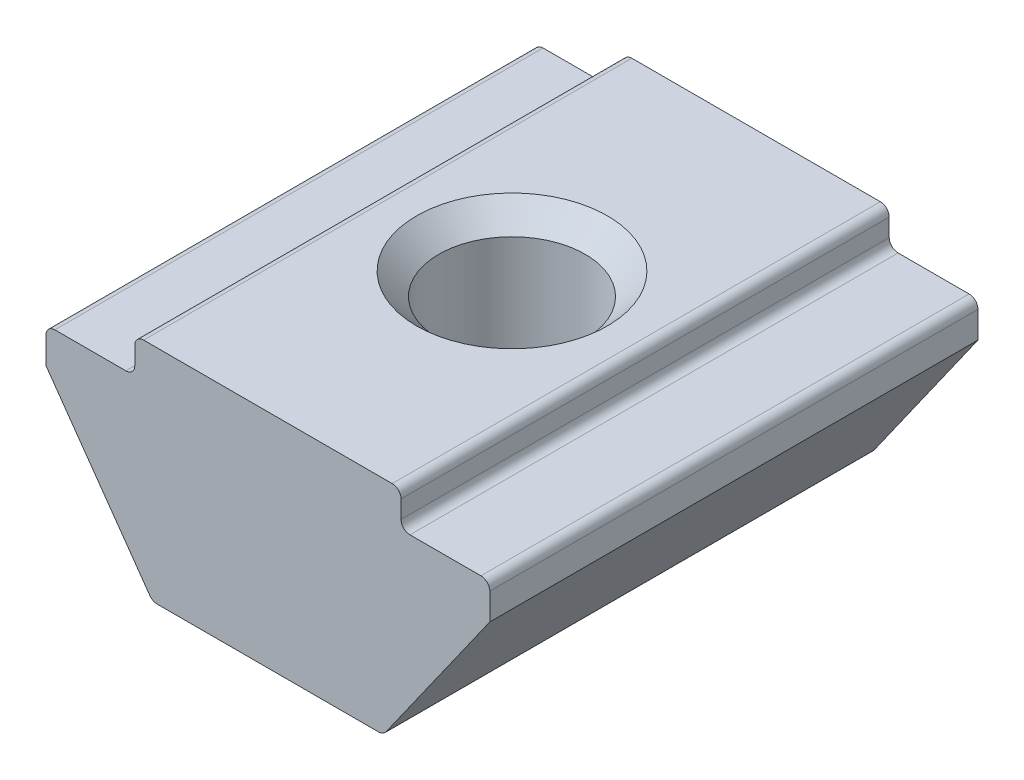
ISO-10303-21;
HEADER;
FILE_DESCRIPTION(('STEP AP214'),'2;1');
FILE_NAME('part.step','',(''),(''),'','','');
FILE_SCHEMA(('AUTOMOTIVE_DESIGN { 1 0 10303 214 1 1 1 1 }'));
ENDSEC;
DATA;
#1=APPLICATION_CONTEXT('core data for automotive mechanical design processes');
#2=APPLICATION_PROTOCOL_DEFINITION('international standard','automotive_design',2000,#1);
#3=PRODUCT_CONTEXT('',#1,'mechanical');
#4=PRODUCT('Part','Part','',(#3));
#5=PRODUCT_RELATED_PRODUCT_CATEGORY('part','',(#4));
#6=PRODUCT_DEFINITION_FORMATION('','',#4);
#7=PRODUCT_DEFINITION_CONTEXT('part definition',#1,'design');
#8=PRODUCT_DEFINITION('design','',#6,#7);
#9=PRODUCT_DEFINITION_SHAPE('','',#8);
#10=(LENGTH_UNIT() NAMED_UNIT(*) SI_UNIT(.MILLI.,.METRE.));
#11=(NAMED_UNIT(*) PLANE_ANGLE_UNIT() SI_UNIT($,.RADIAN.));
#12=(NAMED_UNIT(*) SI_UNIT($,.STERADIAN.) SOLID_ANGLE_UNIT());
#13=UNCERTAINTY_MEASURE_WITH_UNIT(LENGTH_MEASURE(1.E-05),#10,'distance_accuracy_value','');
#14=(GEOMETRIC_REPRESENTATION_CONTEXT(3) GLOBAL_UNCERTAINTY_ASSIGNED_CONTEXT((#13)) GLOBAL_UNIT_ASSIGNED_CONTEXT((#10,
#11,#12)) REPRESENTATION_CONTEXT('',''));
#15=CARTESIAN_POINT('',(0.,0.,0.));
#16=DIRECTION('',(0.,0.,1.));
#17=DIRECTION('',(1.,0.,0.));
#18=AXIS2_PLACEMENT_3D('',#15,#16,#17);
#19=CARTESIAN_POINT('',(-3.00000000000001,0.,5.5));
#20=DIRECTION('',(1.,0.,0.));
#21=DIRECTION('',(0.,1.,0.));
#22=AXIS2_PLACEMENT_3D('',#19,#20,#21);
#23=PLANE('',#22);
#24=DIRECTION('',(0.,-1.,0.));
#25=VECTOR('',#24,1.);
#26=CARTESIAN_POINT('',(-3.00000000000001,0.,5.5));
#27=LINE('',#26,#25);
#28=CARTESIAN_POINT('',(-3.,-0.200000000000002,5.5));
#29=VERTEX_POINT('',#28);
#30=CARTESIAN_POINT('',(-3.,-0.599999999999998,5.5));
#31=VERTEX_POINT('',#30);
#32=EDGE_CURVE('E257',#29,#31,#27,.T.);
#33=ORIENTED_EDGE('',*,*,#32,.F.);
#34=DIRECTION('',(0.,0.,-1.));
#35=VECTOR('',#34,1.);
#36=CARTESIAN_POINT('',(-3.,-0.200000000000002,5.5));
#37=LINE('',#36,#35);
#38=CARTESIAN_POINT('',(-3.,-0.200000000000002,-5.5));
#39=VERTEX_POINT('',#38);
#40=EDGE_CURVE('E333',#29,#39,#37,.T.);
#41=ORIENTED_EDGE('',*,*,#40,.T.);
#42=DIRECTION('',(0.,-1.,0.));
#43=VECTOR('',#42,1.);
#44=CARTESIAN_POINT('',(-3.00000000000001,0.,-5.5));
#45=LINE('',#44,#43);
#46=CARTESIAN_POINT('',(-3.,-0.599999999999998,-5.5));
#47=VERTEX_POINT('',#46);
#48=EDGE_CURVE('E221',#39,#47,#45,.T.);
#49=ORIENTED_EDGE('',*,*,#48,.T.);
#50=DIRECTION('',(0.,0.,-1.));
#51=VECTOR('',#50,1.);
#52=CARTESIAN_POINT('',(-3.,-0.599999999999998,5.5));
#53=LINE('',#52,#51);
#54=EDGE_CURVE('E330',#47,#31,#53,.F.);
#55=ORIENTED_EDGE('',*,*,#54,.T.);
#56=EDGE_LOOP('',(#33,#41,#49,#55));
#57=FACE_BOUND('',#56,.T.);
#58=ADVANCED_FACE('F39',(#57),#23,.F.);
#59=CARTESIAN_POINT('',(-3.,-0.799999999999999,5.5));
#60=DIRECTION('',(0.,-1.,0.));
#61=DIRECTION('',(1.,0.,0.));
#62=AXIS2_PLACEMENT_3D('',#59,#60,#61);
#63=PLANE('',#62);
#64=DIRECTION('',(-1.,0.,0.));
#65=VECTOR('',#64,1.);
#66=CARTESIAN_POINT('',(-3.,-0.799999999999999,-5.5));
#67=LINE('',#66,#65);
#68=CARTESIAN_POINT('',(-3.2,-0.799999999999999,-5.5));
#69=VERTEX_POINT('',#68);
#70=CARTESIAN_POINT('',(-4.8,-0.8,-5.5));
#71=VERTEX_POINT('',#70);
#72=EDGE_CURVE('E225',#69,#71,#67,.T.);
#73=ORIENTED_EDGE('',*,*,#72,.T.);
#74=DIRECTION('',(0.,0.,-1.));
#75=VECTOR('',#74,1.);
#76=CARTESIAN_POINT('',(-4.8,-0.8,5.5));
#77=LINE('',#76,#75);
#78=CARTESIAN_POINT('',(-4.8,-0.8,5.5));
#79=VERTEX_POINT('',#78);
#80=EDGE_CURVE('E344',#71,#79,#77,.F.);
#81=ORIENTED_EDGE('',*,*,#80,.T.);
#82=DIRECTION('',(-1.,0.,0.));
#83=VECTOR('',#82,1.);
#84=CARTESIAN_POINT('',(-3.,-0.799999999999999,5.5));
#85=LINE('',#84,#83);
#86=CARTESIAN_POINT('',(-3.2,-0.799999999999999,5.5));
#87=VERTEX_POINT('',#86);
#88=EDGE_CURVE('E179',#87,#79,#85,.T.);
#89=ORIENTED_EDGE('',*,*,#88,.F.);
#90=DIRECTION('',(0.,0.,-1.));
#91=VECTOR('',#90,1.);
#92=CARTESIAN_POINT('',(-3.2,-0.799999999999999,-5.5));
#93=LINE('',#92,#91);
#94=EDGE_CURVE('E340',#87,#69,#93,.T.);
#95=ORIENTED_EDGE('',*,*,#94,.T.);
#96=EDGE_LOOP('',(#73,#81,#89,#95));
#97=FACE_BOUND('',#96,.T.);
#98=ADVANCED_FACE('F369',(#97),#63,.F.);
#99=CARTESIAN_POINT('',(-5.,-0.8,5.5));
#100=DIRECTION('',(1.,0.,0.));
#101=DIRECTION('',(0.,0.,-1.));
#102=AXIS2_PLACEMENT_3D('',#99,#100,#101);
#103=PLANE('',#102);
#104=DIRECTION('',(0.,-1.,0.));
#105=VECTOR('',#104,1.);
#106=CARTESIAN_POINT('',(-5.,-0.8,5.5));
#107=LINE('',#106,#105);
#108=CARTESIAN_POINT('',(-5.,-1.,5.5));
#109=VERTEX_POINT('',#108);
#110=CARTESIAN_POINT('',(-5.,-1.6,5.5));
#111=VERTEX_POINT('',#110);
#112=EDGE_CURVE('E165',#109,#111,#107,.T.);
#113=ORIENTED_EDGE('',*,*,#112,.F.);
#114=DIRECTION('',(0.,0.,-1.));
#115=VECTOR('',#114,1.);
#116=CARTESIAN_POINT('',(-5.,-1.,5.5));
#117=LINE('',#116,#115);
#118=CARTESIAN_POINT('',(-5.,-1.,-5.5));
#119=VERTEX_POINT('',#118);
#120=EDGE_CURVE('E337',#109,#119,#117,.T.);
#121=ORIENTED_EDGE('',*,*,#120,.T.);
#122=DIRECTION('',(0.,-1.,0.));
#123=VECTOR('',#122,1.);
#124=CARTESIAN_POINT('',(-5.,-0.8,-5.5));
#125=LINE('',#124,#123);
#126=CARTESIAN_POINT('',(-5.,-1.6,-5.5));
#127=VERTEX_POINT('',#126);
#128=EDGE_CURVE('E185',#119,#127,#125,.T.);
#129=ORIENTED_EDGE('',*,*,#128,.T.);
#130=DIRECTION('',(0.,0.,-1.));
#131=VECTOR('',#130,1.);
#132=CARTESIAN_POINT('',(-5.,-1.6,5.5));
#133=LINE('',#132,#131);
#134=EDGE_CURVE('E182',#111,#127,#133,.T.);
#135=ORIENTED_EDGE('',*,*,#134,.F.);
#136=EDGE_LOOP('',(#113,#121,#129,#135));
#137=FACE_BOUND('',#136,.T.);
#138=ADVANCED_FACE('F183',(#137),#103,.F.);
#139=CARTESIAN_POINT('',(-5.,-1.6,5.5));
#140=DIRECTION('',(0.816967863264762,0.576683197598655,0.));
#141=DIRECTION('',(-0.576683197598655,0.816967863264762,0.));
#142=AXIS2_PLACEMENT_3D('',#139,#140,#141);
#143=PLANE('',#142);
#144=DIRECTION('',(0.576683197598655,-0.816967863264762,0.));
#145=VECTOR('',#144,1.);
#146=CARTESIAN_POINT('',(-5.,-1.6,-5.5));
#147=LINE('',#146,#145);
#148=CARTESIAN_POINT('',(-2.65976237210372,-4.91533663951973,-5.5));
#149=VERTEX_POINT('',#148);
#150=EDGE_CURVE('E232',#127,#149,#147,.T.);
#151=ORIENTED_EDGE('',*,*,#150,.T.);
#152=DIRECTION('',(0.,0.,-1.));
#153=VECTOR('',#152,1.);
#154=CARTESIAN_POINT('',(-2.65976237210372,-4.91533663951973,5.5));
#155=LINE('',#154,#153);
#156=CARTESIAN_POINT('',(-2.65976237210372,-4.91533663951973,5.5));
#157=VERTEX_POINT('',#156);
#158=EDGE_CURVE('E195',#149,#157,#155,.F.);
#159=ORIENTED_EDGE('',*,*,#158,.T.);
#160=DIRECTION('',(0.576683197598655,-0.816967863264762,0.));
#161=VECTOR('',#160,1.);
#162=CARTESIAN_POINT('',(-5.,-1.6,5.5));
#163=LINE('',#162,#161);
#164=EDGE_CURVE('E170',#111,#157,#163,.T.);
#165=ORIENTED_EDGE('',*,*,#164,.F.);
#166=ORIENTED_EDGE('',*,*,#134,.T.);
#167=EDGE_LOOP('',(#151,#159,#165,#166));
#168=FACE_BOUND('',#167,.T.);
#169=ADVANCED_FACE('F193',(#168),#143,.F.);
#170=CARTESIAN_POINT('',(-2.6,-5.,5.5));
#171=DIRECTION('',(0.,1.,0.));
#172=DIRECTION('',(0.,0.,1.));
#173=AXIS2_PLACEMENT_3D('',#170,#171,#172);
#174=PLANE('',#173);
#175=CARTESIAN_POINT('',(0.,-5.,0.));
#176=DIRECTION('',(0.,1.,0.));
#177=DIRECTION('',(0.,0.,1.));
#178=AXIS2_PLACEMENT_3D('',#175,#176,#177);
#179=CIRCLE('',#178,2.15);
#180=CARTESIAN_POINT('',(0.,-5.,2.15));
#181=VERTEX_POINT('',#180);
#182=EDGE_CURVE('E387',#181,#181,#179,.T.);
#183=ORIENTED_EDGE('',*,*,#182,.T.);
#184=EDGE_LOOP('',(#183));
#185=FACE_BOUND('',#184,.T.);
#186=DIRECTION('',(1.,0.,0.));
#187=VECTOR('',#186,1.);
#188=CARTESIAN_POINT('',(-2.6,-5.,-5.5));
#189=LINE('',#188,#187);
#190=CARTESIAN_POINT('',(-2.49636879945077,-5.,-5.5));
#191=VERTEX_POINT('',#190);
#192=CARTESIAN_POINT('',(2.49636879945077,-5.,-5.5));
#193=VERTEX_POINT('',#192);
#194=EDGE_CURVE('E235',#191,#193,#189,.T.);
#195=ORIENTED_EDGE('',*,*,#194,.T.);
#196=DIRECTION('',(0.,0.,-1.));
#197=VECTOR('',#196,1.);
#198=CARTESIAN_POINT('',(2.49636879945077,-5.,5.5));
#199=LINE('',#198,#197);
#200=CARTESIAN_POINT('',(2.49636879945077,-5.,5.5));
#201=VERTEX_POINT('',#200);
#202=EDGE_CURVE('E286',#193,#201,#199,.F.);
#203=ORIENTED_EDGE('',*,*,#202,.T.);
#204=DIRECTION('',(1.,0.,0.));
#205=VECTOR('',#204,1.);
#206=CARTESIAN_POINT('',(-2.6,-5.,5.5));
#207=LINE('',#206,#205);
#208=CARTESIAN_POINT('',(-2.49636879945077,-5.,5.5));
#209=VERTEX_POINT('',#208);
#210=EDGE_CURVE('E197',#209,#201,#207,.T.);
#211=ORIENTED_EDGE('',*,*,#210,.F.);
#212=DIRECTION('',(0.,0.,-1.));
#213=VECTOR('',#212,1.);
#214=CARTESIAN_POINT('',(-2.49636879945077,-5.,5.5));
#215=LINE('',#214,#213);
#216=EDGE_CURVE('E282',#209,#191,#215,.T.);
#217=ORIENTED_EDGE('',*,*,#216,.T.);
#218=EDGE_LOOP('',(#195,#203,#211,#217));
#219=FACE_BOUND('',#218,.T.);
#220=ADVANCED_FACE('F393',(#185,#219),#174,.F.);
#221=CARTESIAN_POINT('',(5.,-1.6,5.5));
#222=DIRECTION('',(-0.816967863264762,0.576683197598655,0.));
#223=DIRECTION('',(-0.576683197598655,-0.816967863264762,0.));
#224=AXIS2_PLACEMENT_3D('',#221,#222,#223);
#225=PLANE('',#224);
#226=DIRECTION('',(0.576683197598655,0.816967863264762,0.));
#227=VECTOR('',#226,1.);
#228=CARTESIAN_POINT('',(5.,-1.6,5.5));
#229=LINE('',#228,#227);
#230=CARTESIAN_POINT('',(2.65976237210372,-4.91533663951973,5.5));
#231=VERTEX_POINT('',#230);
#232=CARTESIAN_POINT('',(5.,-1.6,5.5));
#233=VERTEX_POINT('',#232);
#234=EDGE_CURVE('E201',#231,#233,#229,.T.);
#235=ORIENTED_EDGE('',*,*,#234,.F.);
#236=DIRECTION('',(0.,0.,-1.));
#237=VECTOR('',#236,1.);
#238=CARTESIAN_POINT('',(2.65976237210372,-4.91533663951973,5.5));
#239=LINE('',#238,#237);
#240=CARTESIAN_POINT('',(2.65976237210372,-4.91533663951973,-5.5));
#241=VERTEX_POINT('',#240);
#242=EDGE_CURVE('E190',#231,#241,#239,.T.);
#243=ORIENTED_EDGE('',*,*,#242,.T.);
#244=DIRECTION('',(0.576683197598655,0.816967863264762,0.));
#245=VECTOR('',#244,1.);
#246=CARTESIAN_POINT('',(5.,-1.6,-5.5));
#247=LINE('',#246,#245);
#248=CARTESIAN_POINT('',(5.,-1.6,-5.5));
#249=VERTEX_POINT('',#248);
#250=EDGE_CURVE('E239',#241,#249,#247,.T.);
#251=ORIENTED_EDGE('',*,*,#250,.T.);
#252=DIRECTION('',(0.,0.,-1.));
#253=VECTOR('',#252,1.);
#254=CARTESIAN_POINT('',(5.,-1.6,5.5));
#255=LINE('',#254,#253);
#256=EDGE_CURVE('E191',#233,#249,#255,.T.);
#257=ORIENTED_EDGE('',*,*,#256,.F.);
#258=EDGE_LOOP('',(#235,#243,#251,#257));
#259=FACE_BOUND('',#258,.T.);
#260=ADVANCED_FACE('F449',(#259),#225,.F.);
#261=CARTESIAN_POINT('',(5.,-0.8,5.5));
#262=DIRECTION('',(-1.,0.,0.));
#263=DIRECTION('',(0.,0.,1.));
#264=AXIS2_PLACEMENT_3D('',#261,#262,#263);
#265=PLANE('',#264);
#266=DIRECTION('',(0.,1.,0.));
#267=VECTOR('',#266,1.);
#268=CARTESIAN_POINT('',(5.,-0.8,-5.5));
#269=LINE('',#268,#267);
#270=CARTESIAN_POINT('',(5.,-1.,-5.5));
#271=VERTEX_POINT('',#270);
#272=EDGE_CURVE('E242',#249,#271,#269,.T.);
#273=ORIENTED_EDGE('',*,*,#272,.T.);
#274=DIRECTION('',(0.,0.,-1.));
#275=VECTOR('',#274,1.);
#276=CARTESIAN_POINT('',(5.,-1.,5.5));
#277=LINE('',#276,#275);
#278=CARTESIAN_POINT('',(5.,-1.,5.5));
#279=VERTEX_POINT('',#278);
#280=EDGE_CURVE('E314',#271,#279,#277,.F.);
#281=ORIENTED_EDGE('',*,*,#280,.T.);
#282=DIRECTION('',(0.,1.,0.));
#283=VECTOR('',#282,1.);
#284=CARTESIAN_POINT('',(5.,-0.8,5.5));
#285=LINE('',#284,#283);
#286=EDGE_CURVE('E207',#233,#279,#285,.T.);
#287=ORIENTED_EDGE('',*,*,#286,.F.);
#288=ORIENTED_EDGE('',*,*,#256,.T.);
#289=EDGE_LOOP('',(#273,#281,#287,#288));
#290=FACE_BOUND('',#289,.T.);
#291=ADVANCED_FACE('F444',(#290),#265,.F.);
#292=CARTESIAN_POINT('',(3.,-0.799999999999999,5.5));
#293=DIRECTION('',(0.,-1.,0.));
#294=DIRECTION('',(1.,0.,0.));
#295=AXIS2_PLACEMENT_3D('',#292,#293,#294);
#296=PLANE('',#295);
#297=DIRECTION('',(-1.,0.,0.));
#298=VECTOR('',#297,1.);
#299=CARTESIAN_POINT('',(3.,-0.799999999999999,5.5));
#300=LINE('',#299,#298);
#301=CARTESIAN_POINT('',(4.8,-0.8,5.5));
#302=VERTEX_POINT('',#301);
#303=CARTESIAN_POINT('',(3.2,-0.799999999999999,5.5));
#304=VERTEX_POINT('',#303);
#305=EDGE_CURVE('E211',#302,#304,#300,.T.);
#306=ORIENTED_EDGE('',*,*,#305,.F.);
#307=DIRECTION('',(0.,0.,-1.));
#308=VECTOR('',#307,1.);
#309=CARTESIAN_POINT('',(4.8,-0.8,5.5));
#310=LINE('',#309,#308);
#311=CARTESIAN_POINT('',(4.8,-0.8,-5.5));
#312=VERTEX_POINT('',#311);
#313=EDGE_CURVE('E310',#302,#312,#310,.T.);
#314=ORIENTED_EDGE('',*,*,#313,.T.);
#315=DIRECTION('',(-1.,0.,0.));
#316=VECTOR('',#315,1.);
#317=CARTESIAN_POINT('',(3.,-0.799999999999999,-5.5));
#318=LINE('',#317,#316);
#319=CARTESIAN_POINT('',(3.2,-0.799999999999999,-5.5));
#320=VERTEX_POINT('',#319);
#321=EDGE_CURVE('E246',#312,#320,#318,.T.);
#322=ORIENTED_EDGE('',*,*,#321,.T.);
#323=DIRECTION('',(0.,0.,-1.));
#324=VECTOR('',#323,1.);
#325=CARTESIAN_POINT('',(3.2,-0.799999999999999,5.5));
#326=LINE('',#325,#324);
#327=EDGE_CURVE('E307',#320,#304,#326,.F.);
#328=ORIENTED_EDGE('',*,*,#327,.T.);
#329=EDGE_LOOP('',(#306,#314,#322,#328));
#330=FACE_BOUND('',#329,.T.);
#331=ADVANCED_FACE('F436',(#330),#296,.F.);
#332=CARTESIAN_POINT('',(3.00000000000001,0.,5.5));
#333=DIRECTION('',(-1.,0.,0.));
#334=DIRECTION('',(0.,-1.,0.));
#335=AXIS2_PLACEMENT_3D('',#332,#333,#334);
#336=PLANE('',#335);
#337=DIRECTION('',(0.,1.,0.));
#338=VECTOR('',#337,1.);
#339=CARTESIAN_POINT('',(3.00000000000001,0.,5.5));
#340=LINE('',#339,#338);
#341=CARTESIAN_POINT('',(3.,-0.599999999999998,5.5));
#342=VERTEX_POINT('',#341);
#343=CARTESIAN_POINT('',(3.,-0.200000000000002,5.5));
#344=VERTEX_POINT('',#343);
#345=EDGE_CURVE('E215',#342,#344,#340,.T.);
#346=ORIENTED_EDGE('',*,*,#345,.F.);
#347=DIRECTION('',(0.,0.,-1.));
#348=VECTOR('',#347,1.);
#349=CARTESIAN_POINT('',(3.,-0.599999999999998,-5.5));
#350=LINE('',#349,#348);
#351=CARTESIAN_POINT('',(3.,-0.599999999999998,-5.5));
#352=VERTEX_POINT('',#351);
#353=EDGE_CURVE('E320',#342,#352,#350,.T.);
#354=ORIENTED_EDGE('',*,*,#353,.T.);
#355=DIRECTION('',(0.,1.,0.));
#356=VECTOR('',#355,1.);
#357=CARTESIAN_POINT('',(3.00000000000001,0.,-5.5));
#358=LINE('',#357,#356);
#359=CARTESIAN_POINT('',(3.,-0.200000000000002,-5.5));
#360=VERTEX_POINT('',#359);
#361=EDGE_CURVE('E250',#352,#360,#358,.T.);
#362=ORIENTED_EDGE('',*,*,#361,.T.);
#363=DIRECTION('',(0.,0.,-1.));
#364=VECTOR('',#363,1.);
#365=CARTESIAN_POINT('',(3.,-0.200000000000002,5.5));
#366=LINE('',#365,#364);
#367=EDGE_CURVE('E317',#360,#344,#366,.F.);
#368=ORIENTED_EDGE('',*,*,#367,.T.);
#369=EDGE_LOOP('',(#346,#354,#362,#368));
#370=FACE_BOUND('',#369,.T.);
#371=ADVANCED_FACE('F417',(#370),#336,.F.);
#372=CARTESIAN_POINT('',(3.00000000000001,0.,5.5));
#373=DIRECTION('',(0.,-1.,0.));
#374=DIRECTION('',(0.,0.,-1.));
#375=AXIS2_PLACEMENT_3D('',#372,#373,#374);
#376=PLANE('',#375);
#377=CARTESIAN_POINT('',(0.,0.,0.));
#378=DIRECTION('',(0.,1.,0.));
#379=DIRECTION('',(0.,0.,1.));
#380=AXIS2_PLACEMENT_3D('',#377,#378,#379);
#381=CIRCLE('',#380,2.15);
#382=CARTESIAN_POINT('',(0.,0.,2.15));
#383=VERTEX_POINT('',#382);
#384=EDGE_CURVE('E383',#383,#383,#381,.T.);
#385=ORIENTED_EDGE('',*,*,#384,.F.);
#386=EDGE_LOOP('',(#385));
#387=FACE_BOUND('',#386,.T.);
#388=DIRECTION('',(-1.,0.,0.));
#389=VECTOR('',#388,1.);
#390=CARTESIAN_POINT('',(3.00000000000001,0.,5.5));
#391=LINE('',#390,#389);
#392=CARTESIAN_POINT('',(2.8,0.,5.5));
#393=VERTEX_POINT('',#392);
#394=CARTESIAN_POINT('',(-2.8,0.,5.5));
#395=VERTEX_POINT('',#394);
#396=EDGE_CURVE('E218',#393,#395,#391,.T.);
#397=ORIENTED_EDGE('',*,*,#396,.F.);
#398=DIRECTION('',(0.,0.,-1.));
#399=VECTOR('',#398,1.);
#400=CARTESIAN_POINT('',(2.8,0.,5.5));
#401=LINE('',#400,#399);
#402=CARTESIAN_POINT('',(2.8,0.,-5.5));
#403=VERTEX_POINT('',#402);
#404=EDGE_CURVE('E326',#393,#403,#401,.T.);
#405=ORIENTED_EDGE('',*,*,#404,.T.);
#406=DIRECTION('',(-1.,0.,0.));
#407=VECTOR('',#406,1.);
#408=CARTESIAN_POINT('',(3.00000000000001,0.,-5.5));
#409=LINE('',#408,#407);
#410=CARTESIAN_POINT('',(-2.8,0.,-5.5));
#411=VERTEX_POINT('',#410);
#412=EDGE_CURVE('E254',#403,#411,#409,.T.);
#413=ORIENTED_EDGE('',*,*,#412,.T.);
#414=DIRECTION('',(0.,0.,-1.));
#415=VECTOR('',#414,1.);
#416=CARTESIAN_POINT('',(-2.80000000000001,0.,5.5));
#417=LINE('',#416,#415);
#418=EDGE_CURVE('E55',#411,#395,#417,.F.);
#419=ORIENTED_EDGE('',*,*,#418,.T.);
#420=EDGE_LOOP('',(#397,#405,#413,#419));
#421=FACE_BOUND('',#420,.T.);
#422=ADVANCED_FACE('F415',(#387,#421),#376,.F.);
#423=CARTESIAN_POINT('',(0.,0.,5.5));
#424=DIRECTION('',(0.,0.,-1.));
#425=DIRECTION('',(-1.,0.,0.));
#426=AXIS2_PLACEMENT_3D('',#423,#424,#425);
#427=PLANE('',#426);
#428=ORIENTED_EDGE('',*,*,#210,.T.);
#429=CARTESIAN_POINT('',(2.49636879945077,-4.8,5.5));
#430=DIRECTION('',(0.,0.,-1.));
#431=DIRECTION('',(-1.,0.,0.));
#432=AXIS2_PLACEMENT_3D('',#429,#430,#431);
#433=CIRCLE('',#432,0.2);
#434=EDGE_CURVE('E302',#201,#231,#433,.F.);
#435=ORIENTED_EDGE('',*,*,#434,.T.);
#436=ORIENTED_EDGE('',*,*,#234,.T.);
#437=ORIENTED_EDGE('',*,*,#286,.T.);
#438=CARTESIAN_POINT('',(4.8,-1.,5.5));
#439=DIRECTION('',(0.,0.,-1.));
#440=DIRECTION('',(-1.,0.,0.));
#441=AXIS2_PLACEMENT_3D('',#438,#439,#440);
#442=CIRCLE('',#441,0.2);
#443=EDGE_CURVE('E296',#279,#302,#442,.F.);
#444=ORIENTED_EDGE('',*,*,#443,.T.);
#445=ORIENTED_EDGE('',*,*,#305,.T.);
#446=CARTESIAN_POINT('',(3.2,-0.6,5.5));
#447=DIRECTION('',(0.,0.,-1.));
#448=DIRECTION('',(-1.,0.,0.));
#449=AXIS2_PLACEMENT_3D('',#446,#447,#448);
#450=CIRCLE('',#449,0.2);
#451=EDGE_CURVE('E350',#304,#342,#450,.T.);
#452=ORIENTED_EDGE('',*,*,#451,.T.);
#453=ORIENTED_EDGE('',*,*,#345,.T.);
#454=CARTESIAN_POINT('',(2.8,-0.2,5.5));
#455=DIRECTION('',(0.,0.,-1.));
#456=DIRECTION('',(-1.,0.,0.));
#457=AXIS2_PLACEMENT_3D('',#454,#455,#456);
#458=CIRCLE('',#457,0.2);
#459=EDGE_CURVE('E62',#344,#393,#458,.F.);
#460=ORIENTED_EDGE('',*,*,#459,.T.);
#461=ORIENTED_EDGE('',*,*,#396,.T.);
#462=CARTESIAN_POINT('',(-2.8,-0.2,5.5));
#463=DIRECTION('',(0.,0.,-1.));
#464=DIRECTION('',(-1.,0.,0.));
#465=AXIS2_PLACEMENT_3D('',#462,#463,#464);
#466=CIRCLE('',#465,0.2);
#467=EDGE_CURVE('E291',#395,#29,#466,.F.);
#468=ORIENTED_EDGE('',*,*,#467,.T.);
#469=ORIENTED_EDGE('',*,*,#32,.T.);
#470=CARTESIAN_POINT('',(-3.2,-0.6,5.5));
#471=DIRECTION('',(0.,0.,-1.));
#472=DIRECTION('',(-1.,0.,0.));
#473=AXIS2_PLACEMENT_3D('',#470,#471,#472);
#474=CIRCLE('',#473,0.2);
#475=EDGE_CURVE('E11',#31,#87,#474,.T.);
#476=ORIENTED_EDGE('',*,*,#475,.T.);
#477=ORIENTED_EDGE('',*,*,#88,.T.);
#478=CARTESIAN_POINT('',(-4.8,-1.,5.5));
#479=DIRECTION('',(0.,0.,-1.));
#480=DIRECTION('',(-1.,0.,0.));
#481=AXIS2_PLACEMENT_3D('',#478,#479,#480);
#482=CIRCLE('',#481,0.2);
#483=EDGE_CURVE('E174',#79,#109,#482,.F.);
#484=ORIENTED_EDGE('',*,*,#483,.T.);
#485=ORIENTED_EDGE('',*,*,#112,.T.);
#486=ORIENTED_EDGE('',*,*,#164,.T.);
#487=CARTESIAN_POINT('',(-2.49636879945077,-4.8,5.5));
#488=DIRECTION('',(0.,0.,-1.));
#489=DIRECTION('',(-1.,0.,0.));
#490=AXIS2_PLACEMENT_3D('',#487,#488,#489);
#491=CIRCLE('',#490,0.2);
#492=EDGE_CURVE('E299',#157,#209,#491,.F.);
#493=ORIENTED_EDGE('',*,*,#492,.T.);
#494=EDGE_LOOP('',(#428,#435,#436,#437,#444,#445,#452,#453,#460,#461,#468,#469,#476,#477,#484,
#485,#486,#493));
#495=FACE_BOUND('',#494,.T.);
#496=ADVANCED_FACE('F168',(#495),#427,.F.);
#497=CARTESIAN_POINT('',(0.,0.,-5.5));
#498=DIRECTION('',(0.,0.,-1.));
#499=DIRECTION('',(-1.,0.,0.));
#500=AXIS2_PLACEMENT_3D('',#497,#498,#499);
#501=PLANE('',#500);
#502=ORIENTED_EDGE('',*,*,#250,.F.);
#503=CARTESIAN_POINT('',(2.49636879945077,-4.8,-5.5));
#504=DIRECTION('',(0.,0.,-1.));
#505=DIRECTION('',(-1.,0.,0.));
#506=AXIS2_PLACEMENT_3D('',#503,#504,#505);
#507=CIRCLE('',#506,0.2);
#508=EDGE_CURVE('E279',#241,#193,#507,.T.);
#509=ORIENTED_EDGE('',*,*,#508,.T.);
#510=ORIENTED_EDGE('',*,*,#194,.F.);
#511=CARTESIAN_POINT('',(-2.49636879945077,-4.8,-5.5));
#512=DIRECTION('',(0.,0.,-1.));
#513=DIRECTION('',(-1.,0.,0.));
#514=AXIS2_PLACEMENT_3D('',#511,#512,#513);
#515=CIRCLE('',#514,0.2);
#516=EDGE_CURVE('E276',#191,#149,#515,.T.);
#517=ORIENTED_EDGE('',*,*,#516,.T.);
#518=ORIENTED_EDGE('',*,*,#150,.F.);
#519=ORIENTED_EDGE('',*,*,#128,.F.);
#520=CARTESIAN_POINT('',(-4.8,-1.,-5.5));
#521=DIRECTION('',(0.,0.,-1.));
#522=DIRECTION('',(-1.,0.,0.));
#523=AXIS2_PLACEMENT_3D('',#520,#521,#522);
#524=CIRCLE('',#523,0.2);
#525=EDGE_CURVE('E264',#119,#71,#524,.T.);
#526=ORIENTED_EDGE('',*,*,#525,.T.);
#527=ORIENTED_EDGE('',*,*,#72,.F.);
#528=CARTESIAN_POINT('',(-3.2,-0.6,-5.5));
#529=DIRECTION('',(0.,0.,-1.));
#530=DIRECTION('',(-1.,0.,0.));
#531=AXIS2_PLACEMENT_3D('',#528,#529,#530);
#532=CIRCLE('',#531,0.2);
#533=EDGE_CURVE('E48',#69,#47,#532,.F.);
#534=ORIENTED_EDGE('',*,*,#533,.T.);
#535=ORIENTED_EDGE('',*,*,#48,.F.);
#536=CARTESIAN_POINT('',(-2.8,-0.2,-5.5));
#537=DIRECTION('',(0.,0.,-1.));
#538=DIRECTION('',(-1.,0.,0.));
#539=AXIS2_PLACEMENT_3D('',#536,#537,#538);
#540=CIRCLE('',#539,0.2);
#541=EDGE_CURVE('E267',#39,#411,#540,.T.);
#542=ORIENTED_EDGE('',*,*,#541,.T.);
#543=ORIENTED_EDGE('',*,*,#412,.F.);
#544=CARTESIAN_POINT('',(2.8,-0.2,-5.5));
#545=DIRECTION('',(0.,0.,-1.));
#546=DIRECTION('',(-1.,0.,0.));
#547=AXIS2_PLACEMENT_3D('',#544,#545,#546);
#548=CIRCLE('',#547,0.2);
#549=EDGE_CURVE('E270',#403,#360,#548,.T.);
#550=ORIENTED_EDGE('',*,*,#549,.T.);
#551=ORIENTED_EDGE('',*,*,#361,.F.);
#552=CARTESIAN_POINT('',(3.2,-0.6,-5.5));
#553=DIRECTION('',(0.,0.,-1.));
#554=DIRECTION('',(-1.,0.,0.));
#555=AXIS2_PLACEMENT_3D('',#552,#553,#554);
#556=CIRCLE('',#555,0.2);
#557=EDGE_CURVE('E347',#352,#320,#556,.F.);
#558=ORIENTED_EDGE('',*,*,#557,.T.);
#559=ORIENTED_EDGE('',*,*,#321,.F.);
#560=CARTESIAN_POINT('',(4.8,-1.,-5.5));
#561=DIRECTION('',(0.,0.,-1.));
#562=DIRECTION('',(-1.,0.,0.));
#563=AXIS2_PLACEMENT_3D('',#560,#561,#562);
#564=CIRCLE('',#563,0.2);
#565=EDGE_CURVE('E273',#312,#271,#564,.T.);
#566=ORIENTED_EDGE('',*,*,#565,.T.);
#567=ORIENTED_EDGE('',*,*,#272,.F.);
#568=EDGE_LOOP('',(#502,#509,#510,#517,#518,#519,#526,#527,#534,#535,#542,#543,#550,#551,#558,
#559,#566,#567));
#569=FACE_BOUND('',#568,.T.);
#570=ADVANCED_FACE('F358',(#569),#501,.T.);
#571=CARTESIAN_POINT('',(0.,-4.5,0.));
#572=DIRECTION('',(0.,-1.,0.));
#573=DIRECTION('',(0.,0.,-1.));
#574=AXIS2_PLACEMENT_3D('',#571,#572,#573);
#575=CONICAL_SURFACE('',#574,1.65,0.785398163397447);
#576=ORIENTED_EDGE('',*,*,#182,.F.);
#577=EDGE_LOOP('',(#576));
#578=FACE_BOUND('',#577,.T.);
#579=CARTESIAN_POINT('',(0.,-4.5,0.));
#580=DIRECTION('',(0.,1.,0.));
#581=DIRECTION('',(0.,0.,1.));
#582=AXIS2_PLACEMENT_3D('',#579,#580,#581);
#583=CIRCLE('',#582,1.65);
#584=CARTESIAN_POINT('',(0.,-4.5,1.65));
#585=VERTEX_POINT('',#584);
#586=EDGE_CURVE('E226',#585,#585,#583,.T.);
#587=ORIENTED_EDGE('',*,*,#586,.T.);
#588=EDGE_LOOP('',(#587));
#589=FACE_BOUND('',#588,.T.);
#590=ADVANCED_FACE('F396',(#578,#589),#575,.F.);
#591=CARTESIAN_POINT('',(0.,0.,0.));
#592=DIRECTION('',(0.,1.,0.));
#593=DIRECTION('',(0.,0.,1.));
#594=AXIS2_PLACEMENT_3D('',#591,#592,#593);
#595=CYLINDRICAL_SURFACE('',#594,1.65);
#596=ORIENTED_EDGE('',*,*,#586,.F.);
#597=EDGE_LOOP('',(#596));
#598=FACE_BOUND('',#597,.T.);
#599=CARTESIAN_POINT('',(0.,-0.5,0.));
#600=DIRECTION('',(0.,1.,0.));
#601=DIRECTION('',(0.,0.,1.));
#602=AXIS2_PLACEMENT_3D('',#599,#600,#601);
#603=CIRCLE('',#602,1.65);
#604=CARTESIAN_POINT('',(0.,-0.5,1.65));
#605=VERTEX_POINT('',#604);
#606=EDGE_CURVE('E379',#605,#605,#603,.T.);
#607=ORIENTED_EDGE('',*,*,#606,.T.);
#608=EDGE_LOOP('',(#607));
#609=FACE_BOUND('',#608,.T.);
#610=ADVANCED_FACE('F399',(#598,#609),#595,.F.);
#611=CARTESIAN_POINT('',(0.,0.,0.));
#612=DIRECTION('',(0.,1.,0.));
#613=DIRECTION('',(0.,0.,1.));
#614=AXIS2_PLACEMENT_3D('',#611,#612,#613);
#615=CONICAL_SURFACE('',#614,2.15,0.785398163397445);
#616=ORIENTED_EDGE('',*,*,#606,.F.);
#617=EDGE_LOOP('',(#616));
#618=FACE_BOUND('',#617,.T.);
#619=ORIENTED_EDGE('',*,*,#384,.T.);
#620=EDGE_LOOP('',(#619));
#621=FACE_BOUND('',#620,.T.);
#622=ADVANCED_FACE('F405',(#618,#621),#615,.F.);
#623=CARTESIAN_POINT('',(2.49636879945077,-4.8,5.5));
#624=DIRECTION('',(0.,0.,-1.));
#625=DIRECTION('',(-1.,0.,0.));
#626=AXIS2_PLACEMENT_3D('',#623,#624,#625);
#627=CYLINDRICAL_SURFACE('',#626,0.2);
#628=ORIENTED_EDGE('',*,*,#434,.F.);
#629=ORIENTED_EDGE('',*,*,#202,.F.);
#630=ORIENTED_EDGE('',*,*,#508,.F.);
#631=ORIENTED_EDGE('',*,*,#242,.F.);
#632=EDGE_LOOP('',(#628,#629,#630,#631));
#633=FACE_BOUND('',#632,.T.);
#634=ADVANCED_FACE('F411',(#633),#627,.T.);
#635=CARTESIAN_POINT('',(-2.49636879945077,-4.8,5.5));
#636=DIRECTION('',(0.,0.,-1.));
#637=DIRECTION('',(-1.,0.,0.));
#638=AXIS2_PLACEMENT_3D('',#635,#636,#637);
#639=CYLINDRICAL_SURFACE('',#638,0.2);
#640=ORIENTED_EDGE('',*,*,#492,.F.);
#641=ORIENTED_EDGE('',*,*,#158,.F.);
#642=ORIENTED_EDGE('',*,*,#516,.F.);
#643=ORIENTED_EDGE('',*,*,#216,.F.);
#644=EDGE_LOOP('',(#640,#641,#642,#643));
#645=FACE_BOUND('',#644,.T.);
#646=ADVANCED_FACE('F458',(#645),#639,.T.);
#647=CARTESIAN_POINT('',(4.8,-1.,5.5));
#648=DIRECTION('',(0.,0.,-1.));
#649=DIRECTION('',(-1.,0.,0.));
#650=AXIS2_PLACEMENT_3D('',#647,#648,#649);
#651=CYLINDRICAL_SURFACE('',#650,0.2);
#652=ORIENTED_EDGE('',*,*,#443,.F.);
#653=ORIENTED_EDGE('',*,*,#280,.F.);
#654=ORIENTED_EDGE('',*,*,#565,.F.);
#655=ORIENTED_EDGE('',*,*,#313,.F.);
#656=EDGE_LOOP('',(#652,#653,#654,#655));
#657=FACE_BOUND('',#656,.T.);
#658=ADVANCED_FACE('F440',(#657),#651,.T.);
#659=CARTESIAN_POINT('',(3.2,-0.6,5.5));
#660=DIRECTION('',(0.,0.,1.));
#661=DIRECTION('',(1.,0.,0.));
#662=AXIS2_PLACEMENT_3D('',#659,#660,#661);
#663=CYLINDRICAL_SURFACE('',#662,0.2);
#664=ORIENTED_EDGE('',*,*,#451,.F.);
#665=ORIENTED_EDGE('',*,*,#327,.F.);
#666=ORIENTED_EDGE('',*,*,#557,.F.);
#667=ORIENTED_EDGE('',*,*,#353,.F.);
#668=EDGE_LOOP('',(#664,#665,#666,#667));
#669=FACE_BOUND('',#668,.T.);
#670=ADVANCED_FACE('F431',(#669),#663,.F.);
#671=CARTESIAN_POINT('',(2.8,-0.2,5.5));
#672=DIRECTION('',(0.,0.,-1.));
#673=DIRECTION('',(-1.,0.,0.));
#674=AXIS2_PLACEMENT_3D('',#671,#672,#673);
#675=CYLINDRICAL_SURFACE('',#674,0.2);
#676=ORIENTED_EDGE('',*,*,#459,.F.);
#677=ORIENTED_EDGE('',*,*,#367,.F.);
#678=ORIENTED_EDGE('',*,*,#549,.F.);
#679=ORIENTED_EDGE('',*,*,#404,.F.);
#680=EDGE_LOOP('',(#676,#677,#678,#679));
#681=FACE_BOUND('',#680,.T.);
#682=ADVANCED_FACE('F423',(#681),#675,.T.);
#683=CARTESIAN_POINT('',(-2.8,-0.2,5.5));
#684=DIRECTION('',(0.,0.,-1.));
#685=DIRECTION('',(-1.,0.,0.));
#686=AXIS2_PLACEMENT_3D('',#683,#684,#685);
#687=CYLINDRICAL_SURFACE('',#686,0.2);
#688=ORIENTED_EDGE('',*,*,#467,.F.);
#689=ORIENTED_EDGE('',*,*,#418,.F.);
#690=ORIENTED_EDGE('',*,*,#541,.F.);
#691=ORIENTED_EDGE('',*,*,#40,.F.);
#692=EDGE_LOOP('',(#688,#689,#690,#691));
#693=FACE_BOUND('',#692,.T.);
#694=ADVANCED_FACE('F462',(#693),#687,.T.);
#695=CARTESIAN_POINT('',(-4.8,-1.,5.5));
#696=DIRECTION('',(0.,0.,-1.));
#697=DIRECTION('',(-1.,0.,0.));
#698=AXIS2_PLACEMENT_3D('',#695,#696,#697);
#699=CYLINDRICAL_SURFACE('',#698,0.2);
#700=ORIENTED_EDGE('',*,*,#483,.F.);
#701=ORIENTED_EDGE('',*,*,#80,.F.);
#702=ORIENTED_EDGE('',*,*,#525,.F.);
#703=ORIENTED_EDGE('',*,*,#120,.F.);
#704=EDGE_LOOP('',(#700,#701,#702,#703));
#705=FACE_BOUND('',#704,.T.);
#706=ADVANCED_FACE('F460',(#705),#699,.T.);
#707=CARTESIAN_POINT('',(-3.2,-0.6,5.5));
#708=DIRECTION('',(0.,0.,1.));
#709=DIRECTION('',(1.,0.,0.));
#710=AXIS2_PLACEMENT_3D('',#707,#708,#709);
#711=CYLINDRICAL_SURFACE('',#710,0.2);
#712=ORIENTED_EDGE('',*,*,#475,.F.);
#713=ORIENTED_EDGE('',*,*,#54,.F.);
#714=ORIENTED_EDGE('',*,*,#533,.F.);
#715=ORIENTED_EDGE('',*,*,#94,.F.);
#716=EDGE_LOOP('',(#712,#713,#714,#715));
#717=FACE_BOUND('',#716,.T.);
#718=ADVANCED_FACE('F41',(#717),#711,.F.);
#719=CLOSED_SHELL('',(#58,#98,#138,#169,#220,#260,#291,#331,#371,#422,#496,#570,#590,#610,#622,
#634,#646,#658,#670,#682,#694,#706,#718));
#720=MANIFOLD_SOLID_BREP('B2',#719);
#721=ADVANCED_BREP_SHAPE_REPRESENTATION('',(#18,#720),#14);
#722=SHAPE_DEFINITION_REPRESENTATION(#9,#721);
ENDSEC;
END-ISO-10303-21;
